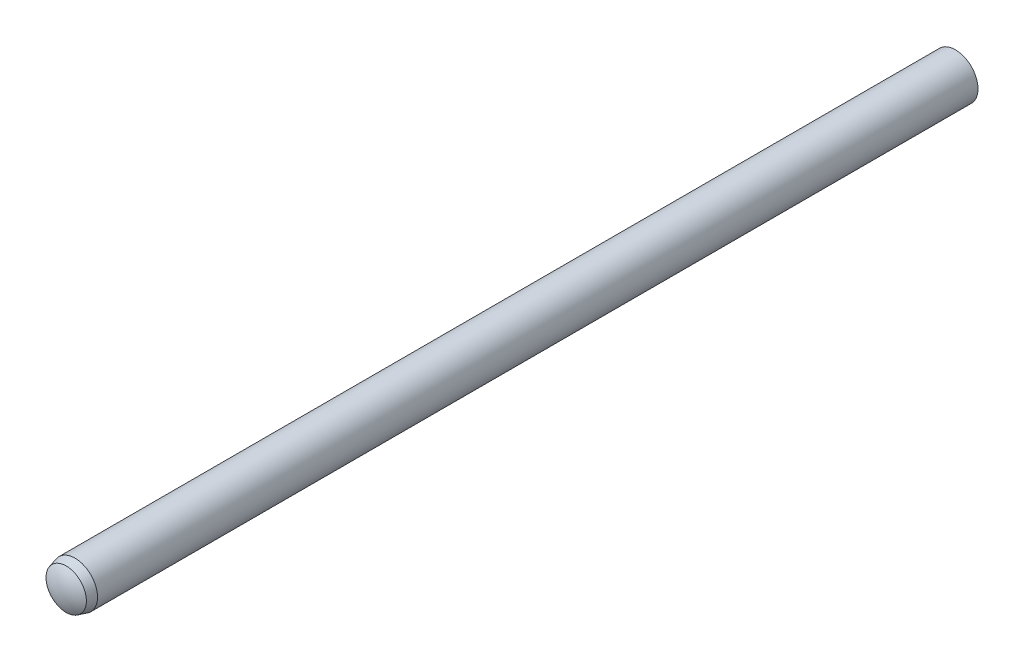
ISO-10303-21;
HEADER;
FILE_DESCRIPTION(('STEP AP214'),'2;1');
FILE_NAME('part.step','',(''),(''),'','','');
FILE_SCHEMA(('AUTOMOTIVE_DESIGN { 1 0 10303 214 1 1 1 1 }'));
ENDSEC;
DATA;
#1=APPLICATION_CONTEXT('core data for automotive mechanical design processes');
#2=APPLICATION_PROTOCOL_DEFINITION('international standard','automotive_design',2000,#1);
#3=PRODUCT_CONTEXT('',#1,'mechanical');
#4=PRODUCT('Part','Part','',(#3));
#5=PRODUCT_RELATED_PRODUCT_CATEGORY('part','',(#4));
#6=PRODUCT_DEFINITION_FORMATION('','',#4);
#7=PRODUCT_DEFINITION_CONTEXT('part definition',#1,'design');
#8=PRODUCT_DEFINITION('design','',#6,#7);
#9=PRODUCT_DEFINITION_SHAPE('','',#8);
#10=(LENGTH_UNIT() NAMED_UNIT(*) SI_UNIT(.MILLI.,.METRE.));
#11=(NAMED_UNIT(*) PLANE_ANGLE_UNIT() SI_UNIT($,.RADIAN.));
#12=(NAMED_UNIT(*) SI_UNIT($,.STERADIAN.) SOLID_ANGLE_UNIT());
#13=UNCERTAINTY_MEASURE_WITH_UNIT(LENGTH_MEASURE(1.E-05),#10,'distance_accuracy_value','');
#14=(GEOMETRIC_REPRESENTATION_CONTEXT(3) GLOBAL_UNCERTAINTY_ASSIGNED_CONTEXT((#13)) GLOBAL_UNIT_ASSIGNED_CONTEXT((#10,
#11,#12)) REPRESENTATION_CONTEXT('',''));
#15=CARTESIAN_POINT('',(0.,0.,0.));
#16=DIRECTION('',(0.,0.,1.));
#17=DIRECTION('',(1.,0.,0.));
#18=AXIS2_PLACEMENT_3D('',#15,#16,#17);
#19=CARTESIAN_POINT('',(0.,0.,-36.3666666666666));
#20=DIRECTION('',(0.,0.,1.));
#21=DIRECTION('',(0.,1.,0.));
#22=AXIS2_PLACEMENT_3D('',#19,#20,#21);
#23=SPHERICAL_SURFACE('',#22,3.63333333333338);
#24=CARTESIAN_POINT('',(0.,0.,-39.4));
#25=DIRECTION('',(0.,0.,1.));
#26=DIRECTION('',(0.,-1.,0.));
#27=AXIS2_PLACEMENT_3D('',#24,#25,#26);
#28=CIRCLE('',#27,1.99999999999999);
#29=CARTESIAN_POINT('',(0.,-1.99999999999997,-39.4));
#30=VERTEX_POINT('',#29);
#31=EDGE_CURVE('E10',#30,#30,#28,.T.);
#32=ORIENTED_EDGE('',*,*,#31,.F.);
#33=EDGE_LOOP('',(#32));
#34=FACE_BOUND('',#33,.T.);
#35=ADVANCED_FACE('F34',(#34),#23,.T.);
#36=CARTESIAN_POINT('',(0.,0.,40.));
#37=DIRECTION('',(0.,0.,1.));
#38=DIRECTION('',(0.,-1.,0.));
#39=AXIS2_PLACEMENT_3D('',#36,#37,#38);
#40=CYLINDRICAL_SURFACE('',#39,1.99999999999999);
#41=CARTESIAN_POINT('',(0.,0.,38.7));
#42=DIRECTION('',(0.,0.,1.));
#43=DIRECTION('',(0.,-1.,0.));
#44=AXIS2_PLACEMENT_3D('',#41,#42,#43);
#45=CIRCLE('',#44,2.);
#46=CARTESIAN_POINT('',(0.,-2.,38.7));
#47=VERTEX_POINT('',#46);
#48=EDGE_CURVE('E40',#47,#47,#45,.T.);
#49=ORIENTED_EDGE('',*,*,#48,.F.);
#50=EDGE_LOOP('',(#49));
#51=FACE_BOUND('',#50,.T.);
#52=ORIENTED_EDGE('',*,*,#31,.T.);
#53=EDGE_LOOP('',(#52));
#54=FACE_BOUND('',#53,.T.);
#55=ADVANCED_FACE('F55',(#51,#54),#40,.T.);
#56=CARTESIAN_POINT('',(0.,0.,38.7));
#57=DIRECTION('',(0.,0.,-1.));
#58=DIRECTION('',(0.,1.,0.));
#59=AXIS2_PLACEMENT_3D('',#56,#57,#58);
#60=CONICAL_SURFACE('',#59,2.,0.261799387799158);
#61=CARTESIAN_POINT('',(0.,0.,39.48));
#62=DIRECTION('',(0.,0.,1.));
#63=DIRECTION('',(0.,-1.,0.));
#64=AXIS2_PLACEMENT_3D('',#61,#62,#63);
#65=CIRCLE('',#64,1.79099962990372);
#66=CARTESIAN_POINT('',(0.,-1.79099962990372,39.48));
#67=VERTEX_POINT('',#66);
#68=EDGE_CURVE('E44',#67,#67,#65,.T.);
#69=ORIENTED_EDGE('',*,*,#68,.F.);
#70=EDGE_LOOP('',(#69));
#71=FACE_BOUND('',#70,.T.);
#72=ORIENTED_EDGE('',*,*,#48,.T.);
#73=EDGE_LOOP('',(#72));
#74=FACE_BOUND('',#73,.T.);
#75=ADVANCED_FACE('F53',(#71,#74),#60,.T.);
#76=CARTESIAN_POINT('',(0.,0.,36.6556926208507));
#77=DIRECTION('',(0.,0.,1.));
#78=DIRECTION('',(0.,1.,0.));
#79=AXIS2_PLACEMENT_3D('',#76,#77,#78);
#80=SPHERICAL_SURFACE('',#79,3.3443073791493);
#81=ORIENTED_EDGE('',*,*,#68,.T.);
#82=EDGE_LOOP('',(#81));
#83=FACE_BOUND('',#82,.T.);
#84=ADVANCED_FACE('F51',(#83),#80,.T.);
#85=CLOSED_SHELL('',(#35,#55,#75,#84));
#86=MANIFOLD_SOLID_BREP('B2',#85);
#87=ADVANCED_BREP_SHAPE_REPRESENTATION('',(#18,#86),#14);
#88=SHAPE_DEFINITION_REPRESENTATION(#9,#87);
ENDSEC;
END-ISO-10303-21;
